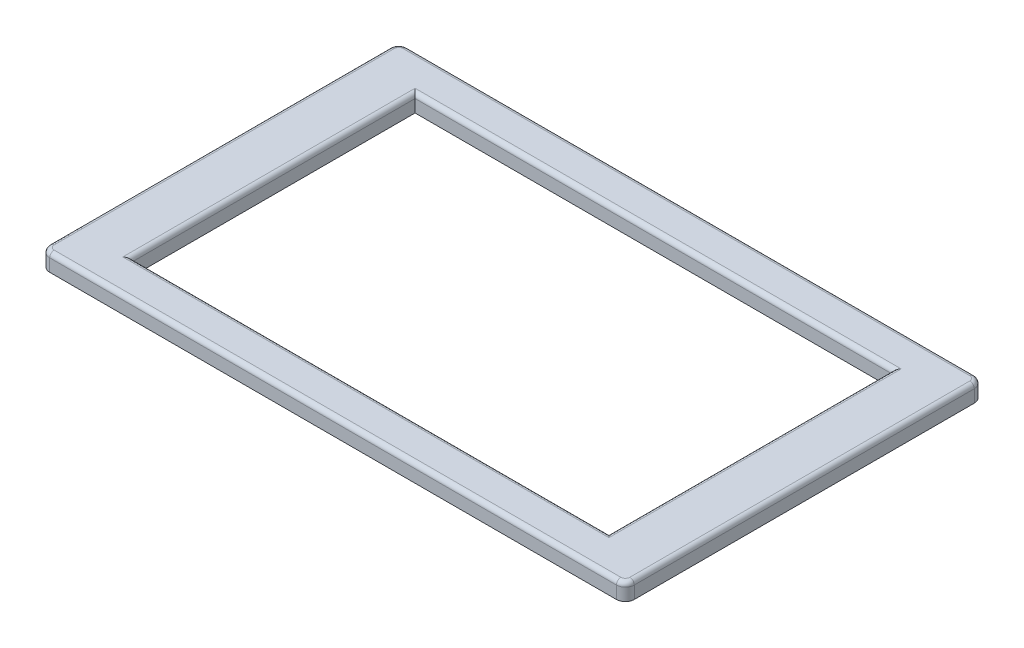
ISO-10303-21;
HEADER;
FILE_DESCRIPTION(('STEP AP214'),'2;1');
FILE_NAME('part.step','',(''),(''),'','','');
FILE_SCHEMA(('AUTOMOTIVE_DESIGN { 1 0 10303 214 1 1 1 1 }'));
ENDSEC;
DATA;
#1=APPLICATION_CONTEXT('core data for automotive mechanical design processes');
#2=APPLICATION_PROTOCOL_DEFINITION('international standard','automotive_design',2000,#1);
#3=PRODUCT_CONTEXT('',#1,'mechanical');
#4=PRODUCT('Part','Part','',(#3));
#5=PRODUCT_RELATED_PRODUCT_CATEGORY('part','',(#4));
#6=PRODUCT_DEFINITION_FORMATION('','',#4);
#7=PRODUCT_DEFINITION_CONTEXT('part definition',#1,'design');
#8=PRODUCT_DEFINITION('design','',#6,#7);
#9=PRODUCT_DEFINITION_SHAPE('','',#8);
#10=(LENGTH_UNIT() NAMED_UNIT(*) SI_UNIT(.MILLI.,.METRE.));
#11=(NAMED_UNIT(*) PLANE_ANGLE_UNIT() SI_UNIT($,.RADIAN.));
#12=(NAMED_UNIT(*) SI_UNIT($,.STERADIAN.) SOLID_ANGLE_UNIT());
#13=UNCERTAINTY_MEASURE_WITH_UNIT(LENGTH_MEASURE(1.E-05),#10,'distance_accuracy_value','');
#14=(GEOMETRIC_REPRESENTATION_CONTEXT(3) GLOBAL_UNCERTAINTY_ASSIGNED_CONTEXT((#13)) GLOBAL_UNIT_ASSIGNED_CONTEXT((#10,
#11,#12)) REPRESENTATION_CONTEXT('',''));
#15=CARTESIAN_POINT('',(0.,0.,0.));
#16=DIRECTION('',(0.,0.,1.));
#17=DIRECTION('',(1.,0.,0.));
#18=AXIS2_PLACEMENT_3D('',#15,#16,#17);
#19=CARTESIAN_POINT('',(4.00000000001397,5.7,-117.));
#20=DIRECTION('',(0.,-1.,0.));
#21=DIRECTION('',(0.,0.,-1.));
#22=AXIS2_PLACEMENT_3D('',#19,#20,#21);
#23=PLANE('',#22);
#24=DIRECTION('',(1.,0.,0.));
#25=VECTOR('',#24,1.);
#26=CARTESIAN_POINT('',(19.000000000014,5.7,-11.));
#27=LINE('',#26,#25);
#28=CARTESIAN_POINT('',(180.500000000014,5.7,-11.));
#29=VERTEX_POINT('',#28);
#30=CARTESIAN_POINT('',(17.500000000014,5.7,-11.));
#31=VERTEX_POINT('',#30);
#32=EDGE_CURVE('E265',#29,#31,#27,.F.);
#33=ORIENTED_EDGE('',*,*,#32,.T.);
#34=DIRECTION('',(0.,0.,1.));
#35=VECTOR('',#34,1.);
#36=CARTESIAN_POINT('',(17.500000000014,5.7,-107.5));
#37=LINE('',#36,#35);
#38=CARTESIAN_POINT('',(17.500000000014,5.7,-109.));
#39=VERTEX_POINT('',#38);
#40=EDGE_CURVE('E267',#31,#39,#37,.F.);
#41=ORIENTED_EDGE('',*,*,#40,.T.);
#42=DIRECTION('',(-1.,0.,0.));
#43=VECTOR('',#42,1.);
#44=CARTESIAN_POINT('',(179.000000000014,5.7,-109.));
#45=LINE('',#44,#43);
#46=CARTESIAN_POINT('',(180.500000000014,5.7,-109.));
#47=VERTEX_POINT('',#46);
#48=EDGE_CURVE('E261',#39,#47,#45,.F.);
#49=ORIENTED_EDGE('',*,*,#48,.T.);
#50=DIRECTION('',(0.,0.,-1.));
#51=VECTOR('',#50,1.);
#52=CARTESIAN_POINT('',(180.500000000014,5.7,-12.5));
#53=LINE('',#52,#51);
#54=EDGE_CURVE('E263',#47,#29,#53,.F.);
#55=ORIENTED_EDGE('',*,*,#54,.T.);
#56=EDGE_LOOP('',(#33,#41,#49,#55));
#57=FACE_BOUND('',#56,.T.);
#58=CARTESIAN_POINT('',(194.000000000014,5.7,-117.));
#59=DIRECTION('',(0.,-1.,0.));
#60=DIRECTION('',(0.,0.,-1.));
#61=AXIS2_PLACEMENT_3D('',#58,#59,#60);
#62=CIRCLE('',#61,1.49999999999998);
#63=CARTESIAN_POINT('',(195.500000000014,5.7,-117.));
#64=VERTEX_POINT('',#63);
#65=CARTESIAN_POINT('',(194.000000000014,5.7,-118.5));
#66=VERTEX_POINT('',#65);
#67=EDGE_CURVE('E256',#64,#66,#62,.F.);
#68=ORIENTED_EDGE('',*,*,#67,.T.);
#69=DIRECTION('',(-1.,0.,0.));
#70=VECTOR('',#69,1.);
#71=CARTESIAN_POINT('',(4.00000000001397,5.7,-118.5));
#72=LINE('',#71,#70);
#73=CARTESIAN_POINT('',(4.00000000001397,5.7,-118.5));
#74=VERTEX_POINT('',#73);
#75=EDGE_CURVE('E258',#66,#74,#72,.T.);
#76=ORIENTED_EDGE('',*,*,#75,.T.);
#77=CARTESIAN_POINT('',(4.00000000001397,5.7,-117.));
#78=DIRECTION('',(0.,-1.,0.));
#79=DIRECTION('',(0.,0.,-1.));
#80=AXIS2_PLACEMENT_3D('',#77,#78,#79);
#81=CIRCLE('',#80,1.5);
#82=CARTESIAN_POINT('',(2.50000000001397,5.7,-117.));
#83=VERTEX_POINT('',#82);
#84=EDGE_CURVE('E244',#74,#83,#81,.F.);
#85=ORIENTED_EDGE('',*,*,#84,.T.);
#86=DIRECTION('',(0.,0.,1.));
#87=VECTOR('',#86,1.);
#88=CARTESIAN_POINT('',(2.50000000001397,5.7,-117.));
#89=LINE('',#88,#87);
#90=CARTESIAN_POINT('',(2.50000000001397,5.7,-2.99999999999999));
#91=VERTEX_POINT('',#90);
#92=EDGE_CURVE('E246',#83,#91,#89,.T.);
#93=ORIENTED_EDGE('',*,*,#92,.T.);
#94=CARTESIAN_POINT('',(4.00000000001397,5.7,-2.99999999999998));
#95=DIRECTION('',(0.,-1.,0.));
#96=DIRECTION('',(0.,0.,-1.));
#97=AXIS2_PLACEMENT_3D('',#94,#95,#96);
#98=CIRCLE('',#97,1.5);
#99=CARTESIAN_POINT('',(4.00000000001395,5.7,-1.49999999999998));
#100=VERTEX_POINT('',#99);
#101=EDGE_CURVE('E248',#91,#100,#98,.F.);
#102=ORIENTED_EDGE('',*,*,#101,.T.);
#103=DIRECTION('',(1.,0.,0.));
#104=VECTOR('',#103,1.);
#105=CARTESIAN_POINT('',(4.00000000001397,5.7,-1.49999999999999));
#106=LINE('',#105,#104);
#107=CARTESIAN_POINT('',(194.000000000014,5.7,-1.49999999999999));
#108=VERTEX_POINT('',#107);
#109=EDGE_CURVE('E250',#100,#108,#106,.T.);
#110=ORIENTED_EDGE('',*,*,#109,.T.);
#111=CARTESIAN_POINT('',(194.000000000014,5.7,-2.99999999999998));
#112=DIRECTION('',(0.,-1.,0.));
#113=DIRECTION('',(0.,0.,-1.));
#114=AXIS2_PLACEMENT_3D('',#111,#112,#113);
#115=CIRCLE('',#114,1.5);
#116=CARTESIAN_POINT('',(195.500000000014,5.7,-2.99999999999998));
#117=VERTEX_POINT('',#116);
#118=EDGE_CURVE('E252',#108,#117,#115,.F.);
#119=ORIENTED_EDGE('',*,*,#118,.T.);
#120=DIRECTION('',(0.,0.,-1.));
#121=VECTOR('',#120,1.);
#122=CARTESIAN_POINT('',(195.500000000014,5.7,-117.));
#123=LINE('',#122,#121);
#124=EDGE_CURVE('E254',#117,#64,#123,.T.);
#125=ORIENTED_EDGE('',*,*,#124,.T.);
#126=EDGE_LOOP('',(#68,#76,#85,#93,#102,#110,#119,#125));
#127=FACE_BOUND('',#126,.T.);
#128=ADVANCED_FACE('F34',(#57,#127),#23,.F.);
#129=CARTESIAN_POINT('',(4.00000000001397,0.,-117.));
#130=DIRECTION('',(0.,-1.,0.));
#131=DIRECTION('',(0.,0.,-1.));
#132=AXIS2_PLACEMENT_3D('',#129,#130,#131);
#133=PLANE('',#132);
#134=CARTESIAN_POINT('',(193.000000000014,0.,-87.387683659692));
#135=DIRECTION('',(0.,-1.,0.));
#136=DIRECTION('',(0.,0.,-1.));
#137=AXIS2_PLACEMENT_3D('',#134,#135,#136);
#138=CIRCLE('',#137,2.);
#139=CARTESIAN_POINT('',(193.000000000014,0.,-89.387683659692));
#140=VERTEX_POINT('',#139);
#141=EDGE_CURVE('E489',#140,#140,#138,.T.);
#142=ORIENTED_EDGE('',*,*,#141,.F.);
#143=EDGE_LOOP('',(#142));
#144=FACE_BOUND('',#143,.T.);
#145=CARTESIAN_POINT('',(193.000000000014,0.,-27.387683659692));
#146=DIRECTION('',(0.,-1.,0.));
#147=DIRECTION('',(0.,0.,-1.));
#148=AXIS2_PLACEMENT_3D('',#145,#146,#147);
#149=CIRCLE('',#148,2.);
#150=CARTESIAN_POINT('',(193.000000000014,0.,-29.387683659692));
#151=VERTEX_POINT('',#150);
#152=EDGE_CURVE('E488',#151,#151,#149,.T.);
#153=ORIENTED_EDGE('',*,*,#152,.F.);
#154=EDGE_LOOP('',(#153));
#155=FACE_BOUND('',#154,.T.);
#156=CARTESIAN_POINT('',(5.00000000001397,0.,-87.387683659692));
#157=DIRECTION('',(0.,-1.,0.));
#158=DIRECTION('',(0.,0.,-1.));
#159=AXIS2_PLACEMENT_3D('',#156,#157,#158);
#160=CIRCLE('',#159,2.);
#161=CARTESIAN_POINT('',(5.00000000001397,0.,-89.387683659692));
#162=VERTEX_POINT('',#161);
#163=EDGE_CURVE('E498',#162,#162,#160,.T.);
#164=ORIENTED_EDGE('',*,*,#163,.F.);
#165=EDGE_LOOP('',(#164));
#166=FACE_BOUND('',#165,.T.);
#167=CARTESIAN_POINT('',(5.00000000001397,0.,-27.387683659692));
#168=DIRECTION('',(0.,-1.,0.));
#169=DIRECTION('',(0.,0.,-1.));
#170=AXIS2_PLACEMENT_3D('',#167,#168,#169);
#171=CIRCLE('',#170,2.);
#172=CARTESIAN_POINT('',(5.00000000001397,0.,-29.387683659692));
#173=VERTEX_POINT('',#172);
#174=EDGE_CURVE('E193',#173,#173,#171,.T.);
#175=ORIENTED_EDGE('',*,*,#174,.F.);
#176=EDGE_LOOP('',(#175));
#177=FACE_BOUND('',#176,.T.);
#178=CARTESIAN_POINT('',(4.00000000001397,0.,-117.));
#179=DIRECTION('',(0.,1.,0.));
#180=DIRECTION('',(0.,0.,-1.));
#181=AXIS2_PLACEMENT_3D('',#178,#179,#180);
#182=CIRCLE('',#181,3.);
#183=CARTESIAN_POINT('',(4.00000000001397,0.,-120.));
#184=VERTEX_POINT('',#183);
#185=CARTESIAN_POINT('',(1.00000000001397,0.,-117.));
#186=VERTEX_POINT('',#185);
#187=EDGE_CURVE('E172',#184,#186,#182,.T.);
#188=ORIENTED_EDGE('',*,*,#187,.F.);
#189=DIRECTION('',(-1.,0.,0.));
#190=VECTOR('',#189,1.);
#191=CARTESIAN_POINT('',(4.00000000001397,0.,-120.));
#192=LINE('',#191,#190);
#193=CARTESIAN_POINT('',(194.000000000014,0.,-120.));
#194=VERTEX_POINT('',#193);
#195=EDGE_CURVE('E223',#194,#184,#192,.T.);
#196=ORIENTED_EDGE('',*,*,#195,.F.);
#197=CARTESIAN_POINT('',(194.000000000014,0.,-117.));
#198=DIRECTION('',(0.,1.,0.));
#199=DIRECTION('',(0.,0.,1.));
#200=AXIS2_PLACEMENT_3D('',#197,#198,#199);
#201=CIRCLE('',#200,2.99999999999998);
#202=CARTESIAN_POINT('',(197.000000000014,0.,-117.));
#203=VERTEX_POINT('',#202);
#204=EDGE_CURVE('E220',#203,#194,#201,.T.);
#205=ORIENTED_EDGE('',*,*,#204,.F.);
#206=DIRECTION('',(0.,0.,-1.));
#207=VECTOR('',#206,1.);
#208=CARTESIAN_POINT('',(197.000000000014,0.,-2.99999999999998));
#209=LINE('',#208,#207);
#210=CARTESIAN_POINT('',(197.000000000014,0.,-2.99999999999998));
#211=VERTEX_POINT('',#210);
#212=EDGE_CURVE('E217',#211,#203,#209,.T.);
#213=ORIENTED_EDGE('',*,*,#212,.F.);
#214=CARTESIAN_POINT('',(194.000000000014,0.,-2.99999999999998));
#215=DIRECTION('',(0.,1.,0.));
#216=DIRECTION('',(0.,0.,-1.));
#217=AXIS2_PLACEMENT_3D('',#214,#215,#216);
#218=CIRCLE('',#217,3.);
#219=CARTESIAN_POINT('',(194.000000000014,0.,0.));
#220=VERTEX_POINT('',#219);
#221=EDGE_CURVE('E214',#220,#211,#218,.T.);
#222=ORIENTED_EDGE('',*,*,#221,.F.);
#223=DIRECTION('',(1.,0.,0.));
#224=VECTOR('',#223,1.);
#225=CARTESIAN_POINT('',(194.000000000014,0.,0.));
#226=LINE('',#225,#224);
#227=CARTESIAN_POINT('',(4.00000000001395,0.,0.));
#228=VERTEX_POINT('',#227);
#229=EDGE_CURVE('E211',#228,#220,#226,.T.);
#230=ORIENTED_EDGE('',*,*,#229,.F.);
#231=CARTESIAN_POINT('',(4.00000000001397,0.,-2.99999999999998));
#232=DIRECTION('',(0.,1.,0.));
#233=DIRECTION('',(0.,0.,1.));
#234=AXIS2_PLACEMENT_3D('',#231,#232,#233);
#235=CIRCLE('',#234,3.);
#236=CARTESIAN_POINT('',(1.00000000001397,0.,-3.));
#237=VERTEX_POINT('',#236);
#238=EDGE_CURVE('E208',#237,#228,#235,.T.);
#239=ORIENTED_EDGE('',*,*,#238,.F.);
#240=DIRECTION('',(0.,0.,1.));
#241=VECTOR('',#240,1.);
#242=CARTESIAN_POINT('',(1.00000000001397,0.,-3.));
#243=LINE('',#242,#241);
#244=EDGE_CURVE('E205',#186,#237,#243,.T.);
#245=ORIENTED_EDGE('',*,*,#244,.F.);
#246=EDGE_LOOP('',(#188,#196,#205,#213,#222,#230,#239,#245));
#247=FACE_BOUND('',#246,.T.);
#248=DIRECTION('',(0.,0.,-1.));
#249=VECTOR('',#248,1.);
#250=CARTESIAN_POINT('',(179.000000000014,0.,-107.5));
#251=LINE('',#250,#249);
#252=CARTESIAN_POINT('',(179.000000000014,0.,-12.5));
#253=VERTEX_POINT('',#252);
#254=CARTESIAN_POINT('',(179.000000000014,0.,-107.5));
#255=VERTEX_POINT('',#254);
#256=EDGE_CURVE('E186',#253,#255,#251,.T.);
#257=ORIENTED_EDGE('',*,*,#256,.T.);
#258=DIRECTION('',(-1.,0.,0.));
#259=VECTOR('',#258,1.);
#260=CARTESIAN_POINT('',(19.000000000014,0.,-107.5));
#261=LINE('',#260,#259);
#262=CARTESIAN_POINT('',(19.000000000014,0.,-107.5));
#263=VERTEX_POINT('',#262);
#264=EDGE_CURVE('E165',#255,#263,#261,.T.);
#265=ORIENTED_EDGE('',*,*,#264,.T.);
#266=DIRECTION('',(0.,0.,1.));
#267=VECTOR('',#266,1.);
#268=CARTESIAN_POINT('',(19.000000000014,0.,-12.5));
#269=LINE('',#268,#267);
#270=CARTESIAN_POINT('',(19.000000000014,0.,-12.5));
#271=VERTEX_POINT('',#270);
#272=EDGE_CURVE('E176',#263,#271,#269,.T.);
#273=ORIENTED_EDGE('',*,*,#272,.T.);
#274=DIRECTION('',(1.,0.,0.));
#275=VECTOR('',#274,1.);
#276=CARTESIAN_POINT('',(179.000000000014,0.,-12.5));
#277=LINE('',#276,#275);
#278=EDGE_CURVE('E182',#271,#253,#277,.T.);
#279=ORIENTED_EDGE('',*,*,#278,.T.);
#280=EDGE_LOOP('',(#257,#265,#273,#279));
#281=FACE_BOUND('',#280,.T.);
#282=ADVANCED_FACE('F184',(#144,#155,#166,#177,#247,#281),#133,.T.);
#283=CARTESIAN_POINT('',(4.00000000001397,5.7,-117.));
#284=DIRECTION('',(0.,-1.,0.));
#285=DIRECTION('',(0.,0.,-1.));
#286=AXIS2_PLACEMENT_3D('',#283,#284,#285);
#287=CYLINDRICAL_SURFACE('',#286,3.);
#288=DIRECTION('',(0.,-1.,0.));
#289=VECTOR('',#288,1.);
#290=CARTESIAN_POINT('',(1.00000000001397,5.7,-117.));
#291=LINE('',#290,#289);
#292=CARTESIAN_POINT('',(1.00000000001397,4.2,-117.));
#293=VERTEX_POINT('',#292);
#294=EDGE_CURVE('E240',#293,#186,#291,.T.);
#295=ORIENTED_EDGE('',*,*,#294,.F.);
#296=CARTESIAN_POINT('',(4.00000000001397,4.2,-117.));
#297=DIRECTION('',(0.,-1.,0.));
#298=DIRECTION('',(0.,0.,-1.));
#299=AXIS2_PLACEMENT_3D('',#296,#297,#298);
#300=CIRCLE('',#299,3.);
#301=CARTESIAN_POINT('',(4.00000000001397,4.2,-120.));
#302=VERTEX_POINT('',#301);
#303=EDGE_CURVE('E11',#293,#302,#300,.T.);
#304=ORIENTED_EDGE('',*,*,#303,.T.);
#305=DIRECTION('',(0.,-1.,0.));
#306=VECTOR('',#305,1.);
#307=CARTESIAN_POINT('',(4.00000000001397,5.7,-120.));
#308=LINE('',#307,#306);
#309=EDGE_CURVE('E226',#302,#184,#308,.T.);
#310=ORIENTED_EDGE('',*,*,#309,.T.);
#311=ORIENTED_EDGE('',*,*,#187,.T.);
#312=EDGE_LOOP('',(#295,#304,#310,#311));
#313=FACE_BOUND('',#312,.T.);
#314=ADVANCED_FACE('F368',(#313),#287,.T.);
#315=CARTESIAN_POINT('',(1.00000000001397,5.7,-3.));
#316=DIRECTION('',(1.,0.,0.));
#317=DIRECTION('',(0.,0.,-1.));
#318=AXIS2_PLACEMENT_3D('',#315,#316,#317);
#319=PLANE('',#318);
#320=DIRECTION('',(0.,-1.,0.));
#321=VECTOR('',#320,1.);
#322=CARTESIAN_POINT('',(1.00000000001397,5.7,-3.));
#323=LINE('',#322,#321);
#324=CARTESIAN_POINT('',(1.00000000001397,4.2,-3.));
#325=VERTEX_POINT('',#324);
#326=EDGE_CURVE('E238',#325,#237,#323,.T.);
#327=ORIENTED_EDGE('',*,*,#326,.F.);
#328=DIRECTION('',(0.,0.,1.));
#329=VECTOR('',#328,1.);
#330=CARTESIAN_POINT('',(1.00000000001397,4.2,-3.));
#331=LINE('',#330,#329);
#332=EDGE_CURVE('E43',#325,#293,#331,.F.);
#333=ORIENTED_EDGE('',*,*,#332,.T.);
#334=ORIENTED_EDGE('',*,*,#294,.T.);
#335=ORIENTED_EDGE('',*,*,#244,.T.);
#336=EDGE_LOOP('',(#327,#333,#334,#335));
#337=FACE_BOUND('',#336,.T.);
#338=ADVANCED_FACE('F413',(#337),#319,.F.);
#339=CARTESIAN_POINT('',(4.00000000001397,5.7,-2.99999999999998));
#340=DIRECTION('',(0.,-1.,0.));
#341=DIRECTION('',(0.,0.,-1.));
#342=AXIS2_PLACEMENT_3D('',#339,#340,#341);
#343=CYLINDRICAL_SURFACE('',#342,3.);
#344=DIRECTION('',(0.,-1.,0.));
#345=VECTOR('',#344,1.);
#346=CARTESIAN_POINT('',(4.00000000001395,5.7,0.));
#347=LINE('',#346,#345);
#348=CARTESIAN_POINT('',(4.00000000001395,4.2,0.));
#349=VERTEX_POINT('',#348);
#350=EDGE_CURVE('E236',#349,#228,#347,.T.);
#351=ORIENTED_EDGE('',*,*,#350,.F.);
#352=CARTESIAN_POINT('',(4.00000000001397,4.2,-2.99999999999998));
#353=DIRECTION('',(0.,-1.,0.));
#354=DIRECTION('',(0.,0.,-1.));
#355=AXIS2_PLACEMENT_3D('',#352,#353,#354);
#356=CIRCLE('',#355,3.);
#357=EDGE_CURVE('E58',#349,#325,#356,.T.);
#358=ORIENTED_EDGE('',*,*,#357,.T.);
#359=ORIENTED_EDGE('',*,*,#326,.T.);
#360=ORIENTED_EDGE('',*,*,#238,.T.);
#361=EDGE_LOOP('',(#351,#358,#359,#360));
#362=FACE_BOUND('',#361,.T.);
#363=ADVANCED_FACE('F328',(#362),#343,.T.);
#364=CARTESIAN_POINT('',(194.000000000014,5.7,0.));
#365=DIRECTION('',(0.,0.,-1.));
#366=DIRECTION('',(-1.,0.,0.));
#367=AXIS2_PLACEMENT_3D('',#364,#365,#366);
#368=PLANE('',#367);
#369=DIRECTION('',(0.,-1.,0.));
#370=VECTOR('',#369,1.);
#371=CARTESIAN_POINT('',(194.000000000014,5.7,0.));
#372=LINE('',#371,#370);
#373=CARTESIAN_POINT('',(194.000000000014,4.2,0.));
#374=VERTEX_POINT('',#373);
#375=EDGE_CURVE('E234',#374,#220,#372,.T.);
#376=ORIENTED_EDGE('',*,*,#375,.F.);
#377=DIRECTION('',(1.,0.,0.));
#378=VECTOR('',#377,1.);
#379=CARTESIAN_POINT('',(194.000000000014,4.2,0.));
#380=LINE('',#379,#378);
#381=EDGE_CURVE('E284',#374,#349,#380,.F.);
#382=ORIENTED_EDGE('',*,*,#381,.T.);
#383=ORIENTED_EDGE('',*,*,#350,.T.);
#384=ORIENTED_EDGE('',*,*,#229,.T.);
#385=EDGE_LOOP('',(#376,#382,#383,#384));
#386=FACE_BOUND('',#385,.T.);
#387=ADVANCED_FACE('F327',(#386),#368,.F.);
#388=CARTESIAN_POINT('',(194.000000000014,5.7,-2.99999999999998));
#389=DIRECTION('',(0.,-1.,0.));
#390=DIRECTION('',(0.,0.,-1.));
#391=AXIS2_PLACEMENT_3D('',#388,#389,#390);
#392=CYLINDRICAL_SURFACE('',#391,3.);
#393=DIRECTION('',(0.,-1.,0.));
#394=VECTOR('',#393,1.);
#395=CARTESIAN_POINT('',(197.000000000014,5.7,-2.99999999999998));
#396=LINE('',#395,#394);
#397=CARTESIAN_POINT('',(197.000000000014,4.2,-2.99999999999998));
#398=VERTEX_POINT('',#397);
#399=EDGE_CURVE('E232',#398,#211,#396,.T.);
#400=ORIENTED_EDGE('',*,*,#399,.F.);
#401=CARTESIAN_POINT('',(194.000000000014,4.2,-2.99999999999998));
#402=DIRECTION('',(0.,-1.,0.));
#403=DIRECTION('',(0.,0.,-1.));
#404=AXIS2_PLACEMENT_3D('',#401,#402,#403);
#405=CIRCLE('',#404,3.);
#406=EDGE_CURVE('E282',#398,#374,#405,.T.);
#407=ORIENTED_EDGE('',*,*,#406,.T.);
#408=ORIENTED_EDGE('',*,*,#375,.T.);
#409=ORIENTED_EDGE('',*,*,#221,.T.);
#410=EDGE_LOOP('',(#400,#407,#408,#409));
#411=FACE_BOUND('',#410,.T.);
#412=ADVANCED_FACE('F339',(#411),#392,.T.);
#413=CARTESIAN_POINT('',(197.000000000014,5.7,-2.99999999999998));
#414=DIRECTION('',(-1.,0.,0.));
#415=DIRECTION('',(0.,0.,1.));
#416=AXIS2_PLACEMENT_3D('',#413,#414,#415);
#417=PLANE('',#416);
#418=DIRECTION('',(0.,-1.,0.));
#419=VECTOR('',#418,1.);
#420=CARTESIAN_POINT('',(197.000000000014,5.7,-117.));
#421=LINE('',#420,#419);
#422=CARTESIAN_POINT('',(197.000000000014,4.2,-117.));
#423=VERTEX_POINT('',#422);
#424=EDGE_CURVE('E230',#423,#203,#421,.T.);
#425=ORIENTED_EDGE('',*,*,#424,.F.);
#426=DIRECTION('',(0.,0.,-1.));
#427=VECTOR('',#426,1.);
#428=CARTESIAN_POINT('',(197.000000000014,4.2,-2.99999999999998));
#429=LINE('',#428,#427);
#430=EDGE_CURVE('E280',#423,#398,#429,.F.);
#431=ORIENTED_EDGE('',*,*,#430,.T.);
#432=ORIENTED_EDGE('',*,*,#399,.T.);
#433=ORIENTED_EDGE('',*,*,#212,.T.);
#434=EDGE_LOOP('',(#425,#431,#432,#433));
#435=FACE_BOUND('',#434,.T.);
#436=ADVANCED_FACE('F342',(#435),#417,.F.);
#437=CARTESIAN_POINT('',(194.000000000014,5.7,-117.));
#438=DIRECTION('',(0.,-1.,0.));
#439=DIRECTION('',(0.,0.,-1.));
#440=AXIS2_PLACEMENT_3D('',#437,#438,#439);
#441=CYLINDRICAL_SURFACE('',#440,2.99999999999998);
#442=DIRECTION('',(0.,-1.,0.));
#443=VECTOR('',#442,1.);
#444=CARTESIAN_POINT('',(194.000000000014,5.7,-120.));
#445=LINE('',#444,#443);
#446=CARTESIAN_POINT('',(194.000000000014,4.2,-120.));
#447=VERTEX_POINT('',#446);
#448=EDGE_CURVE('E228',#447,#194,#445,.T.);
#449=ORIENTED_EDGE('',*,*,#448,.F.);
#450=CARTESIAN_POINT('',(194.000000000014,4.2,-117.));
#451=DIRECTION('',(0.,-1.,0.));
#452=DIRECTION('',(0.,0.,-1.));
#453=AXIS2_PLACEMENT_3D('',#450,#451,#452);
#454=CIRCLE('',#453,2.99999999999998);
#455=EDGE_CURVE('E278',#447,#423,#454,.T.);
#456=ORIENTED_EDGE('',*,*,#455,.T.);
#457=ORIENTED_EDGE('',*,*,#424,.T.);
#458=ORIENTED_EDGE('',*,*,#204,.T.);
#459=EDGE_LOOP('',(#449,#456,#457,#458));
#460=FACE_BOUND('',#459,.T.);
#461=ADVANCED_FACE('F401',(#460),#441,.T.);
#462=CARTESIAN_POINT('',(4.00000000001397,5.7,-120.));
#463=DIRECTION('',(0.,0.,1.));
#464=DIRECTION('',(1.,0.,0.));
#465=AXIS2_PLACEMENT_3D('',#462,#463,#464);
#466=PLANE('',#465);
#467=ORIENTED_EDGE('',*,*,#309,.F.);
#468=DIRECTION('',(-1.,0.,0.));
#469=VECTOR('',#468,1.);
#470=CARTESIAN_POINT('',(4.00000000001397,4.2,-120.));
#471=LINE('',#470,#469);
#472=EDGE_CURVE('E275',#302,#447,#471,.F.);
#473=ORIENTED_EDGE('',*,*,#472,.T.);
#474=ORIENTED_EDGE('',*,*,#448,.T.);
#475=ORIENTED_EDGE('',*,*,#195,.T.);
#476=EDGE_LOOP('',(#467,#473,#474,#475));
#477=FACE_BOUND('',#476,.T.);
#478=ADVANCED_FACE('F371',(#477),#466,.F.);
#479=CARTESIAN_POINT('',(19.000000000014,5.7,-107.5));
#480=DIRECTION('',(0.,0.,1.));
#481=DIRECTION('',(1.,0.,0.));
#482=AXIS2_PLACEMENT_3D('',#479,#480,#481);
#483=PLANE('',#482);
#484=DIRECTION('',(0.,-1.,0.));
#485=VECTOR('',#484,1.);
#486=CARTESIAN_POINT('',(179.000000000014,5.7,-107.5));
#487=LINE('',#486,#485);
#488=CARTESIAN_POINT('',(179.000000000014,4.2,-107.5));
#489=VERTEX_POINT('',#488);
#490=EDGE_CURVE('E198',#489,#255,#487,.T.);
#491=ORIENTED_EDGE('',*,*,#490,.F.);
#492=DIRECTION('',(-1.,0.,0.));
#493=VECTOR('',#492,1.);
#494=CARTESIAN_POINT('',(19.000000000014,4.2,-107.5));
#495=LINE('',#494,#493);
#496=CARTESIAN_POINT('',(19.000000000014,4.2,-107.5));
#497=VERTEX_POINT('',#496);
#498=EDGE_CURVE('E168',#489,#497,#495,.T.);
#499=ORIENTED_EDGE('',*,*,#498,.T.);
#500=DIRECTION('',(0.,-1.,0.));
#501=VECTOR('',#500,1.);
#502=CARTESIAN_POINT('',(19.000000000014,5.7,-107.5));
#503=LINE('',#502,#501);
#504=EDGE_CURVE('E160',#497,#263,#503,.T.);
#505=ORIENTED_EDGE('',*,*,#504,.T.);
#506=ORIENTED_EDGE('',*,*,#264,.F.);
#507=EDGE_LOOP('',(#491,#499,#505,#506));
#508=FACE_BOUND('',#507,.T.);
#509=ADVANCED_FACE('F163',(#508),#483,.T.);
#510=CARTESIAN_POINT('',(19.000000000014,5.7,-12.5));
#511=DIRECTION('',(1.,0.,0.));
#512=DIRECTION('',(0.,0.,-1.));
#513=AXIS2_PLACEMENT_3D('',#510,#511,#512);
#514=PLANE('',#513);
#515=ORIENTED_EDGE('',*,*,#504,.F.);
#516=DIRECTION('',(0.,0.,1.));
#517=VECTOR('',#516,1.);
#518=CARTESIAN_POINT('',(19.000000000014,4.2,-12.5));
#519=LINE('',#518,#517);
#520=CARTESIAN_POINT('',(19.000000000014,4.2,-12.5));
#521=VERTEX_POINT('',#520);
#522=EDGE_CURVE('E242',#497,#521,#519,.T.);
#523=ORIENTED_EDGE('',*,*,#522,.T.);
#524=DIRECTION('',(0.,-1.,0.));
#525=VECTOR('',#524,1.);
#526=CARTESIAN_POINT('',(19.000000000014,5.7,-12.5));
#527=LINE('',#526,#525);
#528=EDGE_CURVE('E173',#521,#271,#527,.T.);
#529=ORIENTED_EDGE('',*,*,#528,.T.);
#530=ORIENTED_EDGE('',*,*,#272,.F.);
#531=EDGE_LOOP('',(#515,#523,#529,#530));
#532=FACE_BOUND('',#531,.T.);
#533=ADVANCED_FACE('F177',(#532),#514,.T.);
#534=CARTESIAN_POINT('',(179.000000000014,5.7,-12.5));
#535=DIRECTION('',(0.,0.,-1.));
#536=DIRECTION('',(-1.,0.,0.));
#537=AXIS2_PLACEMENT_3D('',#534,#535,#536);
#538=PLANE('',#537);
#539=ORIENTED_EDGE('',*,*,#528,.F.);
#540=DIRECTION('',(1.,0.,0.));
#541=VECTOR('',#540,1.);
#542=CARTESIAN_POINT('',(179.000000000014,4.2,-12.5));
#543=LINE('',#542,#541);
#544=CARTESIAN_POINT('',(179.000000000014,4.2,-12.5));
#545=VERTEX_POINT('',#544);
#546=EDGE_CURVE('E270',#521,#545,#543,.T.);
#547=ORIENTED_EDGE('',*,*,#546,.T.);
#548=DIRECTION('',(0.,-1.,0.));
#549=VECTOR('',#548,1.);
#550=CARTESIAN_POINT('',(179.000000000014,5.7,-12.5));
#551=LINE('',#550,#549);
#552=EDGE_CURVE('E200',#545,#253,#551,.T.);
#553=ORIENTED_EDGE('',*,*,#552,.T.);
#554=ORIENTED_EDGE('',*,*,#278,.F.);
#555=EDGE_LOOP('',(#539,#547,#553,#554));
#556=FACE_BOUND('',#555,.T.);
#557=ADVANCED_FACE('F436',(#556),#538,.T.);
#558=CARTESIAN_POINT('',(179.000000000014,5.7,-107.5));
#559=DIRECTION('',(-1.,0.,0.));
#560=DIRECTION('',(0.,0.,1.));
#561=AXIS2_PLACEMENT_3D('',#558,#559,#560);
#562=PLANE('',#561);
#563=ORIENTED_EDGE('',*,*,#552,.F.);
#564=DIRECTION('',(0.,0.,-1.));
#565=VECTOR('',#564,1.);
#566=CARTESIAN_POINT('',(179.000000000014,4.2,-107.5));
#567=LINE('',#566,#565);
#568=EDGE_CURVE('E272',#545,#489,#567,.T.);
#569=ORIENTED_EDGE('',*,*,#568,.T.);
#570=ORIENTED_EDGE('',*,*,#490,.T.);
#571=ORIENTED_EDGE('',*,*,#256,.F.);
#572=EDGE_LOOP('',(#563,#569,#570,#571));
#573=FACE_BOUND('',#572,.T.);
#574=ADVANCED_FACE('F431',(#573),#562,.T.);
#575=CARTESIAN_POINT('',(180.500000000014,4.2,-107.5));
#576=DIRECTION('',(0.,0.,1.));
#577=DIRECTION('',(1.,0.,0.));
#578=AXIS2_PLACEMENT_3D('',#575,#576,#577);
#579=CYLINDRICAL_SURFACE('',#578,1.5);
#580=CARTESIAN_POINT('',(180.500000000014,4.2,-11.));
#581=DIRECTION('',(-0.707106781186547,0.,0.707106781186548));
#582=DIRECTION('',(-0.707106781186548,0.,-0.707106781186547));
#583=AXIS2_PLACEMENT_3D('',#580,#581,#582);
#584=ELLIPSE('',#583,2.12132034355964,1.5);
#585=EDGE_CURVE('E190',#29,#545,#584,.T.);
#586=ORIENTED_EDGE('',*,*,#585,.F.);
#587=ORIENTED_EDGE('',*,*,#54,.F.);
#588=CARTESIAN_POINT('',(180.500000000014,4.2,-109.));
#589=DIRECTION('',(0.707106781186547,0.,0.707106781186547));
#590=DIRECTION('',(-0.707106781186547,0.,0.707106781186547));
#591=AXIS2_PLACEMENT_3D('',#588,#589,#590);
#592=ELLIPSE('',#591,2.12132034355964,1.5);
#593=EDGE_CURVE('E187',#489,#47,#592,.F.);
#594=ORIENTED_EDGE('',*,*,#593,.F.);
#595=ORIENTED_EDGE('',*,*,#568,.F.);
#596=EDGE_LOOP('',(#586,#587,#594,#595));
#597=FACE_BOUND('',#596,.T.);
#598=ADVANCED_FACE('F428',(#597),#579,.T.);
#599=CARTESIAN_POINT('',(19.000000000014,4.2,-109.));
#600=DIRECTION('',(1.,0.,0.));
#601=DIRECTION('',(0.,0.,-1.));
#602=AXIS2_PLACEMENT_3D('',#599,#600,#601);
#603=CYLINDRICAL_SURFACE('',#602,1.5);
#604=ORIENTED_EDGE('',*,*,#593,.T.);
#605=ORIENTED_EDGE('',*,*,#48,.F.);
#606=CARTESIAN_POINT('',(17.500000000014,4.2,-109.));
#607=DIRECTION('',(0.707106781186547,0.,-0.707106781186547));
#608=DIRECTION('',(-0.707106781186547,0.,-0.707106781186547));
#609=AXIS2_PLACEMENT_3D('',#606,#607,#608);
#610=ELLIPSE('',#609,2.12132034355964,1.5);
#611=EDGE_CURVE('E290',#497,#39,#610,.F.);
#612=ORIENTED_EDGE('',*,*,#611,.F.);
#613=ORIENTED_EDGE('',*,*,#498,.F.);
#614=EDGE_LOOP('',(#604,#605,#612,#613));
#615=FACE_BOUND('',#614,.T.);
#616=ADVANCED_FACE('F425',(#615),#603,.T.);
#617=CARTESIAN_POINT('',(179.000000000014,4.2,-11.));
#618=DIRECTION('',(-1.,0.,0.));
#619=DIRECTION('',(0.,0.,1.));
#620=AXIS2_PLACEMENT_3D('',#617,#618,#619);
#621=CYLINDRICAL_SURFACE('',#620,1.5);
#622=ORIENTED_EDGE('',*,*,#585,.T.);
#623=ORIENTED_EDGE('',*,*,#546,.F.);
#624=CARTESIAN_POINT('',(17.500000000014,4.2,-11.));
#625=DIRECTION('',(-0.707106781186548,0.,-0.707106781186547));
#626=DIRECTION('',(0.707106781186547,0.,-0.707106781186548));
#627=AXIS2_PLACEMENT_3D('',#624,#625,#626);
#628=ELLIPSE('',#627,2.12132034355964,1.5);
#629=EDGE_CURVE('E288',#31,#521,#628,.T.);
#630=ORIENTED_EDGE('',*,*,#629,.F.);
#631=ORIENTED_EDGE('',*,*,#32,.F.);
#632=EDGE_LOOP('',(#622,#623,#630,#631));
#633=FACE_BOUND('',#632,.T.);
#634=ADVANCED_FACE('F421',(#633),#621,.T.);
#635=CARTESIAN_POINT('',(17.500000000014,4.2,-12.5));
#636=DIRECTION('',(0.,0.,-1.));
#637=DIRECTION('',(-1.,0.,0.));
#638=AXIS2_PLACEMENT_3D('',#635,#636,#637);
#639=CYLINDRICAL_SURFACE('',#638,1.5);
#640=ORIENTED_EDGE('',*,*,#611,.T.);
#641=ORIENTED_EDGE('',*,*,#40,.F.);
#642=ORIENTED_EDGE('',*,*,#629,.T.);
#643=ORIENTED_EDGE('',*,*,#522,.F.);
#644=EDGE_LOOP('',(#640,#641,#642,#643));
#645=FACE_BOUND('',#644,.T.);
#646=ADVANCED_FACE('F418',(#645),#639,.T.);
#647=CARTESIAN_POINT('',(4.00000000001397,4.2,-1.49999999999999));
#648=DIRECTION('',(1.,0.,0.));
#649=DIRECTION('',(0.,0.,-1.));
#650=AXIS2_PLACEMENT_3D('',#647,#648,#649);
#651=CYLINDRICAL_SURFACE('',#650,1.5);
#652=CARTESIAN_POINT('',(4.00000000001395,4.2,-1.49999999999998));
#653=DIRECTION('',(-1.,0.,0.));
#654=DIRECTION('',(0.,0.,1.));
#655=AXIS2_PLACEMENT_3D('',#652,#653,#654);
#656=CIRCLE('',#655,1.5);
#657=EDGE_CURVE('E310',#349,#100,#656,.T.);
#658=ORIENTED_EDGE('',*,*,#657,.F.);
#659=ORIENTED_EDGE('',*,*,#381,.F.);
#660=CARTESIAN_POINT('',(194.000000000014,4.2,-1.49999999999999));
#661=DIRECTION('',(1.,0.,0.));
#662=DIRECTION('',(0.,0.,-1.));
#663=AXIS2_PLACEMENT_3D('',#660,#661,#662);
#664=CIRCLE('',#663,1.5);
#665=EDGE_CURVE('E38',#108,#374,#664,.T.);
#666=ORIENTED_EDGE('',*,*,#665,.F.);
#667=ORIENTED_EDGE('',*,*,#109,.F.);
#668=EDGE_LOOP('',(#658,#659,#666,#667));
#669=FACE_BOUND('',#668,.T.);
#670=ADVANCED_FACE('F36',(#669),#651,.T.);
#671=CARTESIAN_POINT('',(194.000000000014,4.2,-2.99999999999998));
#672=DIRECTION('',(0.,-1.,0.));
#673=DIRECTION('',(0.,0.,-1.));
#674=AXIS2_PLACEMENT_3D('',#671,#672,#673);
#675=TOROIDAL_SURFACE('',#674,1.5,1.5);
#676=ORIENTED_EDGE('',*,*,#665,.T.);
#677=ORIENTED_EDGE('',*,*,#406,.F.);
#678=CARTESIAN_POINT('',(195.500000000014,4.2,-2.99999999999998));
#679=DIRECTION('',(0.,0.,-1.));
#680=DIRECTION('',(-1.,0.,0.));
#681=AXIS2_PLACEMENT_3D('',#678,#679,#680);
#682=CIRCLE('',#681,1.5);
#683=EDGE_CURVE('E308',#117,#398,#682,.T.);
#684=ORIENTED_EDGE('',*,*,#683,.F.);
#685=ORIENTED_EDGE('',*,*,#118,.F.);
#686=EDGE_LOOP('',(#676,#677,#684,#685));
#687=FACE_BOUND('',#686,.T.);
#688=ADVANCED_FACE('F320',(#687),#675,.T.);
#689=CARTESIAN_POINT('',(4.00000000001397,4.2,-2.99999999999998));
#690=DIRECTION('',(0.,-1.,0.));
#691=DIRECTION('',(0.,0.,-1.));
#692=AXIS2_PLACEMENT_3D('',#689,#690,#691);
#693=DEGENERATE_TOROIDAL_SURFACE('',#692,1.5,1.5,.T.);
#694=ORIENTED_EDGE('',*,*,#657,.T.);
#695=ORIENTED_EDGE('',*,*,#101,.F.);
#696=CARTESIAN_POINT('',(2.50000000001397,4.2,-2.99999999999999));
#697=DIRECTION('',(0.,0.,-1.));
#698=DIRECTION('',(-1.,0.,0.));
#699=AXIS2_PLACEMENT_3D('',#696,#697,#698);
#700=CIRCLE('',#699,1.5);
#701=EDGE_CURVE('E305',#325,#91,#700,.T.);
#702=ORIENTED_EDGE('',*,*,#701,.F.);
#703=ORIENTED_EDGE('',*,*,#357,.F.);
#704=EDGE_LOOP('',(#694,#695,#702,#703));
#705=FACE_BOUND('',#704,.T.);
#706=ADVANCED_FACE('F357',(#705),#693,.T.);
#707=CARTESIAN_POINT('',(195.500000000014,4.2,-117.));
#708=DIRECTION('',(0.,0.,-1.));
#709=DIRECTION('',(-1.,0.,0.));
#710=AXIS2_PLACEMENT_3D('',#707,#708,#709);
#711=CYLINDRICAL_SURFACE('',#710,1.5);
#712=ORIENTED_EDGE('',*,*,#683,.T.);
#713=ORIENTED_EDGE('',*,*,#430,.F.);
#714=CARTESIAN_POINT('',(195.500000000014,4.2,-117.));
#715=DIRECTION('',(0.,0.,-1.));
#716=DIRECTION('',(-1.,0.,0.));
#717=AXIS2_PLACEMENT_3D('',#714,#715,#716);
#718=CIRCLE('',#717,1.5);
#719=EDGE_CURVE('E302',#64,#423,#718,.T.);
#720=ORIENTED_EDGE('',*,*,#719,.F.);
#721=ORIENTED_EDGE('',*,*,#124,.F.);
#722=EDGE_LOOP('',(#712,#713,#720,#721));
#723=FACE_BOUND('',#722,.T.);
#724=ADVANCED_FACE('F346',(#723),#711,.T.);
#725=CARTESIAN_POINT('',(2.50000000001397,4.2,-117.));
#726=DIRECTION('',(0.,0.,1.));
#727=DIRECTION('',(1.,0.,0.));
#728=AXIS2_PLACEMENT_3D('',#725,#726,#727);
#729=CYLINDRICAL_SURFACE('',#728,1.5);
#730=ORIENTED_EDGE('',*,*,#701,.T.);
#731=ORIENTED_EDGE('',*,*,#92,.F.);
#732=CARTESIAN_POINT('',(2.50000000001397,4.2,-117.));
#733=DIRECTION('',(0.,0.,-1.));
#734=DIRECTION('',(-1.,0.,0.));
#735=AXIS2_PLACEMENT_3D('',#732,#733,#734);
#736=CIRCLE('',#735,1.5);
#737=EDGE_CURVE('E299',#293,#83,#736,.T.);
#738=ORIENTED_EDGE('',*,*,#737,.F.);
#739=ORIENTED_EDGE('',*,*,#332,.F.);
#740=EDGE_LOOP('',(#730,#731,#738,#739));
#741=FACE_BOUND('',#740,.T.);
#742=ADVANCED_FACE('F359',(#741),#729,.T.);
#743=CARTESIAN_POINT('',(194.000000000014,4.2,-117.));
#744=DIRECTION('',(0.,-1.,0.));
#745=DIRECTION('',(0.,0.,-1.));
#746=AXIS2_PLACEMENT_3D('',#743,#744,#745);
#747=DEGENERATE_TOROIDAL_SURFACE('',#746,1.49999999999998,1.5,.T.);
#748=ORIENTED_EDGE('',*,*,#719,.T.);
#749=ORIENTED_EDGE('',*,*,#455,.F.);
#750=CARTESIAN_POINT('',(194.000000000014,4.2,-118.5));
#751=DIRECTION('',(-1.,0.,0.));
#752=DIRECTION('',(0.,0.,1.));
#753=AXIS2_PLACEMENT_3D('',#750,#751,#752);
#754=CIRCLE('',#753,1.5);
#755=EDGE_CURVE('E296',#66,#447,#754,.T.);
#756=ORIENTED_EDGE('',*,*,#755,.F.);
#757=ORIENTED_EDGE('',*,*,#67,.F.);
#758=EDGE_LOOP('',(#748,#749,#756,#757));
#759=FACE_BOUND('',#758,.T.);
#760=ADVANCED_FACE('F351',(#759),#747,.T.);
#761=CARTESIAN_POINT('',(4.00000000001397,4.2,-117.));
#762=DIRECTION('',(0.,-1.,0.));
#763=DIRECTION('',(0.,0.,-1.));
#764=AXIS2_PLACEMENT_3D('',#761,#762,#763);
#765=TOROIDAL_SURFACE('',#764,1.5,1.5);
#766=ORIENTED_EDGE('',*,*,#737,.T.);
#767=ORIENTED_EDGE('',*,*,#84,.F.);
#768=CARTESIAN_POINT('',(4.00000000001397,4.2,-118.5));
#769=DIRECTION('',(1.,0.,0.));
#770=DIRECTION('',(0.,0.,-1.));
#771=AXIS2_PLACEMENT_3D('',#768,#769,#770);
#772=CIRCLE('',#771,1.5);
#773=EDGE_CURVE('E294',#302,#74,#772,.T.);
#774=ORIENTED_EDGE('',*,*,#773,.F.);
#775=ORIENTED_EDGE('',*,*,#303,.F.);
#776=EDGE_LOOP('',(#766,#767,#774,#775));
#777=FACE_BOUND('',#776,.T.);
#778=ADVANCED_FACE('F365',(#777),#765,.T.);
#779=CARTESIAN_POINT('',(4.00000000001397,4.2,-118.5));
#780=DIRECTION('',(-1.,0.,0.));
#781=DIRECTION('',(0.,0.,1.));
#782=AXIS2_PLACEMENT_3D('',#779,#780,#781);
#783=CYLINDRICAL_SURFACE('',#782,1.5);
#784=ORIENTED_EDGE('',*,*,#755,.T.);
#785=ORIENTED_EDGE('',*,*,#472,.F.);
#786=ORIENTED_EDGE('',*,*,#773,.T.);
#787=ORIENTED_EDGE('',*,*,#75,.F.);
#788=EDGE_LOOP('',(#784,#785,#786,#787));
#789=FACE_BOUND('',#788,.T.);
#790=ADVANCED_FACE('F375',(#789),#783,.T.);
#791=CARTESIAN_POINT('',(5.00000000001397,3.1,-27.387683659692));
#792=DIRECTION('',(0.,-1.,0.));
#793=DIRECTION('',(0.,0.,-1.));
#794=AXIS2_PLACEMENT_3D('',#791,#792,#793);
#795=CYLINDRICAL_SURFACE('',#794,2.);
#796=CARTESIAN_POINT('',(5.00000000001397,3.1,-27.387683659692));
#797=DIRECTION('',(0.,-1.,0.));
#798=DIRECTION('',(0.,0.,-1.));
#799=AXIS2_PLACEMENT_3D('',#796,#797,#798);
#800=CIRCLE('',#799,2.);
#801=CARTESIAN_POINT('',(5.00000000001397,3.1,-29.387683659692));
#802=VERTEX_POINT('',#801);
#803=EDGE_CURVE('E297',#802,#802,#800,.T.);
#804=ORIENTED_EDGE('',*,*,#803,.F.);
#805=EDGE_LOOP('',(#804));
#806=FACE_BOUND('',#805,.T.);
#807=ORIENTED_EDGE('',*,*,#174,.T.);
#808=EDGE_LOOP('',(#807));
#809=FACE_BOUND('',#808,.T.);
#810=ADVANCED_FACE('F377',(#806,#809),#795,.F.);
#811=CARTESIAN_POINT('',(5.00000000001397,3.1,-27.387683659692));
#812=DIRECTION('',(0.,-1.,0.));
#813=DIRECTION('',(0.,0.,-1.));
#814=AXIS2_PLACEMENT_3D('',#811,#812,#813);
#815=PLANE('',#814);
#816=ORIENTED_EDGE('',*,*,#803,.T.);
#817=EDGE_LOOP('',(#816));
#818=FACE_BOUND('',#817,.T.);
#819=ADVANCED_FACE('F383',(#818),#815,.T.);
#820=CARTESIAN_POINT('',(5.00000000001397,3.1,-87.387683659692));
#821=DIRECTION('',(0.,-1.,0.));
#822=DIRECTION('',(0.,0.,-1.));
#823=AXIS2_PLACEMENT_3D('',#820,#821,#822);
#824=CYLINDRICAL_SURFACE('',#823,2.);
#825=CARTESIAN_POINT('',(5.00000000001397,3.1,-87.387683659692));
#826=DIRECTION('',(0.,-1.,0.));
#827=DIRECTION('',(0.,0.,-1.));
#828=AXIS2_PLACEMENT_3D('',#825,#826,#827);
#829=CIRCLE('',#828,2.);
#830=CARTESIAN_POINT('',(5.00000000001397,3.1,-89.387683659692));
#831=VERTEX_POINT('',#830);
#832=EDGE_CURVE('E500',#831,#831,#829,.T.);
#833=ORIENTED_EDGE('',*,*,#832,.F.);
#834=EDGE_LOOP('',(#833));
#835=FACE_BOUND('',#834,.T.);
#836=ORIENTED_EDGE('',*,*,#163,.T.);
#837=EDGE_LOOP('',(#836));
#838=FACE_BOUND('',#837,.T.);
#839=ADVANCED_FACE('F459',(#835,#838),#824,.F.);
#840=CARTESIAN_POINT('',(5.00000000001397,3.1,-87.387683659692));
#841=DIRECTION('',(0.,-1.,0.));
#842=DIRECTION('',(0.,0.,-1.));
#843=AXIS2_PLACEMENT_3D('',#840,#841,#842);
#844=PLANE('',#843);
#845=ORIENTED_EDGE('',*,*,#832,.T.);
#846=EDGE_LOOP('',(#845));
#847=FACE_BOUND('',#846,.T.);
#848=ADVANCED_FACE('F463',(#847),#844,.T.);
#849=CARTESIAN_POINT('',(193.000000000014,3.1,-27.387683659692));
#850=DIRECTION('',(0.,-1.,0.));
#851=DIRECTION('',(0.,0.,-1.));
#852=AXIS2_PLACEMENT_3D('',#849,#850,#851);
#853=CYLINDRICAL_SURFACE('',#852,2.);
#854=CARTESIAN_POINT('',(193.000000000014,3.1,-27.387683659692));
#855=DIRECTION('',(0.,-1.,0.));
#856=DIRECTION('',(0.,0.,-1.));
#857=AXIS2_PLACEMENT_3D('',#854,#855,#856);
#858=CIRCLE('',#857,2.);
#859=CARTESIAN_POINT('',(193.000000000014,3.1,-29.387683659692));
#860=VERTEX_POINT('',#859);
#861=EDGE_CURVE('E492',#860,#860,#858,.T.);
#862=ORIENTED_EDGE('',*,*,#861,.F.);
#863=EDGE_LOOP('',(#862));
#864=FACE_BOUND('',#863,.T.);
#865=ORIENTED_EDGE('',*,*,#152,.T.);
#866=EDGE_LOOP('',(#865));
#867=FACE_BOUND('',#866,.T.);
#868=ADVANCED_FACE('F467',(#864,#867),#853,.F.);
#869=CARTESIAN_POINT('',(193.000000000014,3.1,-27.387683659692));
#870=DIRECTION('',(0.,-1.,0.));
#871=DIRECTION('',(0.,0.,-1.));
#872=AXIS2_PLACEMENT_3D('',#869,#870,#871);
#873=PLANE('',#872);
#874=ORIENTED_EDGE('',*,*,#861,.T.);
#875=EDGE_LOOP('',(#874));
#876=FACE_BOUND('',#875,.T.);
#877=ADVANCED_FACE('F471',(#876),#873,.T.);
#878=CARTESIAN_POINT('',(193.000000000014,3.1,-87.387683659692));
#879=DIRECTION('',(0.,-1.,0.));
#880=DIRECTION('',(0.,0.,-1.));
#881=AXIS2_PLACEMENT_3D('',#878,#879,#880);
#882=CYLINDRICAL_SURFACE('',#881,2.);
#883=CARTESIAN_POINT('',(193.000000000014,3.1,-87.387683659692));
#884=DIRECTION('',(0.,-1.,0.));
#885=DIRECTION('',(0.,0.,-1.));
#886=AXIS2_PLACEMENT_3D('',#883,#884,#885);
#887=CIRCLE('',#886,2.);
#888=CARTESIAN_POINT('',(193.000000000014,3.1,-89.387683659692));
#889=VERTEX_POINT('',#888);
#890=EDGE_CURVE('E487',#889,#889,#887,.T.);
#891=ORIENTED_EDGE('',*,*,#890,.F.);
#892=EDGE_LOOP('',(#891));
#893=FACE_BOUND('',#892,.T.);
#894=ORIENTED_EDGE('',*,*,#141,.T.);
#895=EDGE_LOOP('',(#894));
#896=FACE_BOUND('',#895,.T.);
#897=ADVANCED_FACE('F475',(#893,#896),#882,.F.);
#898=CARTESIAN_POINT('',(193.000000000014,3.1,-87.387683659692));
#899=DIRECTION('',(0.,-1.,0.));
#900=DIRECTION('',(0.,0.,-1.));
#901=AXIS2_PLACEMENT_3D('',#898,#899,#900);
#902=PLANE('',#901);
#903=ORIENTED_EDGE('',*,*,#890,.T.);
#904=EDGE_LOOP('',(#903));
#905=FACE_BOUND('',#904,.T.);
#906=ADVANCED_FACE('F479',(#905),#902,.T.);
#907=CLOSED_SHELL('',(#128,#282,#314,#338,#363,#387,#412,#436,#461,#478,#509,#533,#557,#574,
#598,#616,#634,#646,#670,#688,#706,#724,#742,#760,#778,#790,#810,#819,#839,#848,#868,#877,#897,#906));
#908=MANIFOLD_SOLID_BREP('B2',#907);
#909=ADVANCED_BREP_SHAPE_REPRESENTATION('',(#18,#908),#14);
#910=SHAPE_DEFINITION_REPRESENTATION(#9,#909);
ENDSEC;
END-ISO-10303-21;
